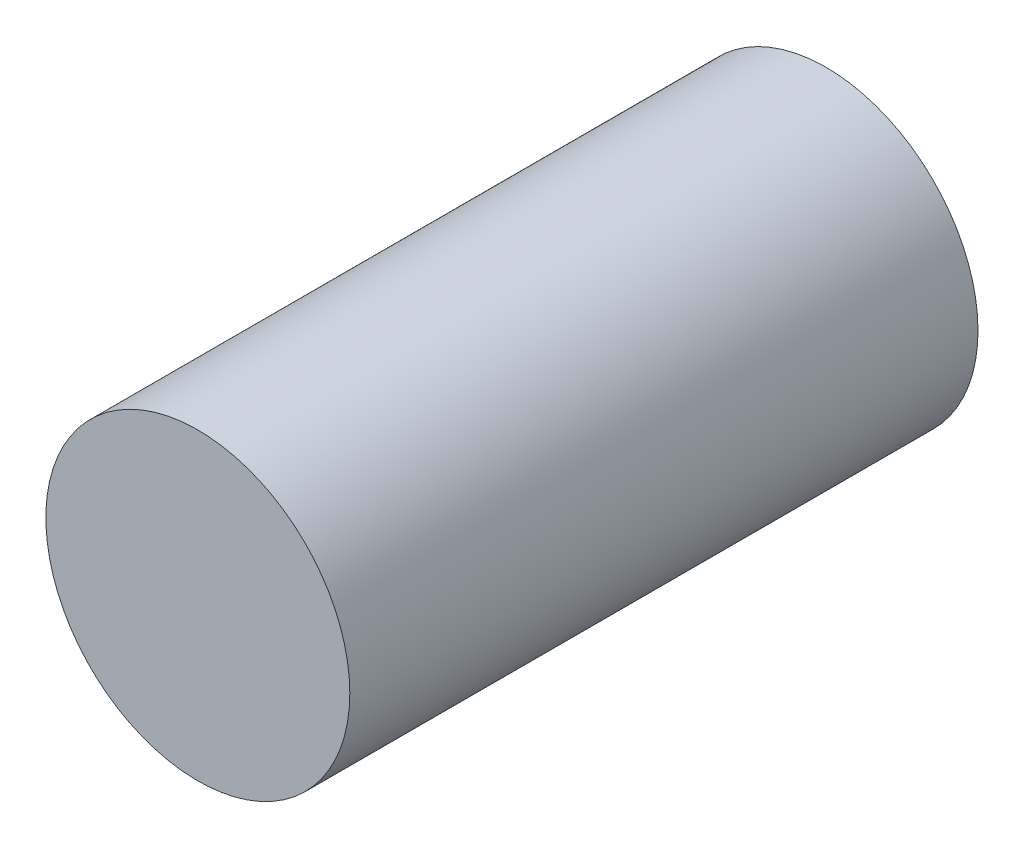
ISO-10303-21;
HEADER;
FILE_DESCRIPTION(('STEP AP214'),'2;1');
FILE_NAME('part.step','',(''),(''),'','','');
FILE_SCHEMA(('AUTOMOTIVE_DESIGN { 1 0 10303 214 1 1 1 1 }'));
ENDSEC;
DATA;
#1=APPLICATION_CONTEXT('core data for automotive mechanical design processes');
#2=APPLICATION_PROTOCOL_DEFINITION('international standard','automotive_design',2000,#1);
#3=PRODUCT_CONTEXT('',#1,'mechanical');
#4=PRODUCT('Part','Part','',(#3));
#5=PRODUCT_RELATED_PRODUCT_CATEGORY('part','',(#4));
#6=PRODUCT_DEFINITION_FORMATION('','',#4);
#7=PRODUCT_DEFINITION_CONTEXT('part definition',#1,'design');
#8=PRODUCT_DEFINITION('design','',#6,#7);
#9=PRODUCT_DEFINITION_SHAPE('','',#8);
#10=(LENGTH_UNIT() NAMED_UNIT(*) SI_UNIT(.MILLI.,.METRE.));
#11=(NAMED_UNIT(*) PLANE_ANGLE_UNIT() SI_UNIT($,.RADIAN.));
#12=(NAMED_UNIT(*) SI_UNIT($,.STERADIAN.) SOLID_ANGLE_UNIT());
#13=UNCERTAINTY_MEASURE_WITH_UNIT(LENGTH_MEASURE(1.E-05),#10,'distance_accuracy_value','');
#14=(GEOMETRIC_REPRESENTATION_CONTEXT(3) GLOBAL_UNCERTAINTY_ASSIGNED_CONTEXT((#13)) GLOBAL_UNIT_ASSIGNED_CONTEXT((#10,
#11,#12)) REPRESENTATION_CONTEXT('',''));
#15=CARTESIAN_POINT('',(0.,0.,0.));
#16=DIRECTION('',(0.,0.,1.));
#17=DIRECTION('',(1.,0.,0.));
#18=AXIS2_PLACEMENT_3D('',#15,#16,#17);
#19=CARTESIAN_POINT('',(0.,0.,31.));
#20=DIRECTION('',(0.,0.,-1.));
#21=DIRECTION('',(-1.,0.,0.));
#22=AXIS2_PLACEMENT_3D('',#19,#20,#21);
#23=CYLINDRICAL_SURFACE('',#22,15.);
#24=CARTESIAN_POINT('',(0.,0.,31.));
#25=DIRECTION('',(0.,0.,1.));
#26=DIRECTION('',(1.,0.,0.));
#27=AXIS2_PLACEMENT_3D('',#24,#25,#26);
#28=CIRCLE('',#27,15.);
#29=CARTESIAN_POINT('',(15.,0.,31.));
#30=VERTEX_POINT('',#29);
#31=EDGE_CURVE('E10',#30,#30,#28,.T.);
#32=ORIENTED_EDGE('',*,*,#31,.F.);
#33=EDGE_LOOP('',(#32));
#34=FACE_BOUND('',#33,.T.);
#35=CARTESIAN_POINT('',(0.,0.,-31.));
#36=DIRECTION('',(0.,0.,1.));
#37=DIRECTION('',(1.,0.,0.));
#38=AXIS2_PLACEMENT_3D('',#35,#36,#37);
#39=CIRCLE('',#38,15.);
#40=CARTESIAN_POINT('',(15.,0.,-31.));
#41=VERTEX_POINT('',#40);
#42=EDGE_CURVE('E40',#41,#41,#39,.T.);
#43=ORIENTED_EDGE('',*,*,#42,.T.);
#44=EDGE_LOOP('',(#43));
#45=FACE_BOUND('',#44,.T.);
#46=ADVANCED_FACE('F37',(#34,#45),#23,.T.);
#47=CARTESIAN_POINT('',(0.,0.,31.));
#48=DIRECTION('',(0.,0.,1.));
#49=DIRECTION('',(1.,0.,0.));
#50=AXIS2_PLACEMENT_3D('',#47,#48,#49);
#51=PLANE('',#50);
#52=ORIENTED_EDGE('',*,*,#31,.T.);
#53=EDGE_LOOP('',(#52));
#54=FACE_BOUND('',#53,.T.);
#55=ADVANCED_FACE('F54',(#54),#51,.T.);
#56=CARTESIAN_POINT('',(0.,0.,-31.));
#57=DIRECTION('',(0.,0.,1.));
#58=DIRECTION('',(1.,0.,0.));
#59=AXIS2_PLACEMENT_3D('',#56,#57,#58);
#60=PLANE('',#59);
#61=ORIENTED_EDGE('',*,*,#42,.F.);
#62=EDGE_LOOP('',(#61));
#63=FACE_BOUND('',#62,.T.);
#64=ADVANCED_FACE('F52',(#63),#60,.F.);
#65=CLOSED_SHELL('',(#46,#55,#64));
#66=MANIFOLD_SOLID_BREP('B2',#65);
#67=ADVANCED_BREP_SHAPE_REPRESENTATION('',(#18,#66),#14);
#68=SHAPE_DEFINITION_REPRESENTATION(#9,#67);
ENDSEC;
END-ISO-10303-21;
